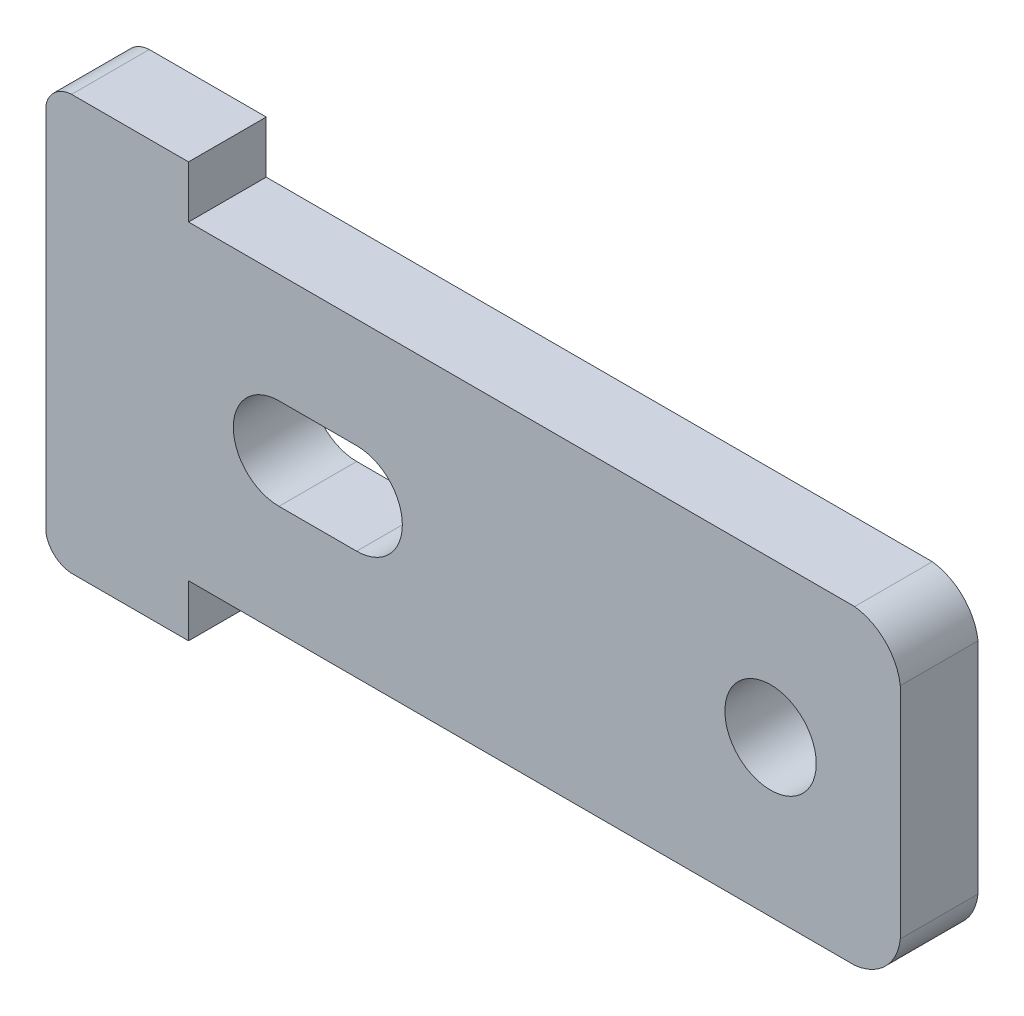
ISO-10303-21;
HEADER;
FILE_DESCRIPTION(('STEP AP214'),'2;1');
FILE_NAME('part.step','',(''),(''),'','','');
FILE_SCHEMA(('AUTOMOTIVE_DESIGN { 1 0 10303 214 1 1 1 1 }'));
ENDSEC;
DATA;
#1=APPLICATION_CONTEXT('core data for automotive mechanical design processes');
#2=APPLICATION_PROTOCOL_DEFINITION('international standard','automotive_design',2000,#1);
#3=PRODUCT_CONTEXT('',#1,'mechanical');
#4=PRODUCT('Part','Part','',(#3));
#5=PRODUCT_RELATED_PRODUCT_CATEGORY('part','',(#4));
#6=PRODUCT_DEFINITION_FORMATION('','',#4);
#7=PRODUCT_DEFINITION_CONTEXT('part definition',#1,'design');
#8=PRODUCT_DEFINITION('design','',#6,#7);
#9=PRODUCT_DEFINITION_SHAPE('','',#8);
#10=(LENGTH_UNIT() NAMED_UNIT(*) SI_UNIT(.MILLI.,.METRE.));
#11=(NAMED_UNIT(*) PLANE_ANGLE_UNIT() SI_UNIT($,.RADIAN.));
#12=(NAMED_UNIT(*) SI_UNIT($,.STERADIAN.) SOLID_ANGLE_UNIT());
#13=UNCERTAINTY_MEASURE_WITH_UNIT(LENGTH_MEASURE(1.E-05),#10,'distance_accuracy_value','');
#14=(GEOMETRIC_REPRESENTATION_CONTEXT(3) GLOBAL_UNCERTAINTY_ASSIGNED_CONTEXT((#13)) GLOBAL_UNIT_ASSIGNED_CONTEXT((#10,
#11,#12)) REPRESENTATION_CONTEXT('',''));
#15=CARTESIAN_POINT('',(0.,0.,0.));
#16=DIRECTION('',(0.,0.,1.));
#17=DIRECTION('',(1.,0.,0.));
#18=AXIS2_PLACEMENT_3D('',#15,#16,#17);
#19=CARTESIAN_POINT('',(46.9587811518595,76.4713390661476,17.9974875144157));
#20=DIRECTION('',(0.,1.,0.));
#21=DIRECTION('',(0.,0.,1.));
#22=AXIS2_PLACEMENT_3D('',#19,#20,#21);
#23=PLANE('',#22);
#24=DIRECTION('',(1.,0.,0.));
#25=VECTOR('',#24,1.);
#26=CARTESIAN_POINT('',(46.9587811518595,76.4713390661476,54.6650738281675));
#27=LINE('',#26,#25);
#28=CARTESIAN_POINT('',(46.9587811518595,76.4713390661476,54.6650738281675));
#29=VERTEX_POINT('',#28);
#30=CARTESIAN_POINT('',(51.4746078539774,76.4713390661476,54.6650738281675));
#31=VERTEX_POINT('',#30);
#32=EDGE_CURVE('E55',#29,#31,#27,.T.);
#33=ORIENTED_EDGE('',*,*,#32,.F.);
#34=DIRECTION('',(0.,0.,1.));
#35=VECTOR('',#34,1.);
#36=CARTESIAN_POINT('',(46.9587811518595,76.4713390661476,17.9974875144157));
#37=LINE('',#36,#35);
#38=CARTESIAN_POINT('',(46.9587811518595,76.4713390661476,57.6650738542446));
#39=VERTEX_POINT('',#38);
#40=EDGE_CURVE('E279',#29,#39,#37,.T.);
#41=ORIENTED_EDGE('',*,*,#40,.T.);
#42=DIRECTION('',(-1.,0.,0.));
#43=VECTOR('',#42,1.);
#44=CARTESIAN_POINT('',(46.9587811518595,76.4713390661476,57.6650738542446));
#45=LINE('',#44,#43);
#46=CARTESIAN_POINT('',(51.4746078539774,76.4713390661476,57.6650738542446));
#47=VERTEX_POINT('',#46);
#48=EDGE_CURVE('E204',#47,#39,#45,.T.);
#49=ORIENTED_EDGE('',*,*,#48,.F.);
#50=DIRECTION('',(0.,0.,1.));
#51=VECTOR('',#50,1.);
#52=CARTESIAN_POINT('',(51.4746078539774,76.4713390661476,17.9974875144157));
#53=LINE('',#52,#51);
#54=EDGE_CURVE('E248',#31,#47,#53,.T.);
#55=ORIENTED_EDGE('',*,*,#54,.F.);
#56=EDGE_LOOP('',(#33,#41,#49,#55));
#57=FACE_BOUND('',#56,.T.);
#58=ADVANCED_FACE('F45',(#57),#23,.T.);
#59=CARTESIAN_POINT('',(47.0069865537006,75.4156807634039,17.9974875144157));
#60=DIRECTION('',(0.,0.,1.));
#61=DIRECTION('',(1.,0.,0.));
#62=AXIS2_PLACEMENT_3D('',#59,#60,#61);
#63=CYLINDRICAL_SURFACE('',#62,1.05675835124136);
#64=CARTESIAN_POINT('',(47.0069865537006,75.4156807634039,54.6650738281675));
#65=DIRECTION('',(0.,0.,1.));
#66=DIRECTION('',(1.,0.,0.));
#67=AXIS2_PLACEMENT_3D('',#64,#65,#66);
#68=CIRCLE('',#67,1.05675835124136);
#69=CARTESIAN_POINT('',(45.9710725832865,75.6245358778236,54.6650738281675));
#70=VERTEX_POINT('',#69);
#71=EDGE_CURVE('E331',#70,#29,#68,.F.);
#72=ORIENTED_EDGE('',*,*,#71,.F.);
#73=DIRECTION('',(0.,0.,1.));
#74=VECTOR('',#73,1.);
#75=CARTESIAN_POINT('',(45.9710725832865,75.6245358778236,17.9974875144157));
#76=LINE('',#75,#74);
#77=CARTESIAN_POINT('',(45.9710725832865,75.6245358778236,57.6650738542446));
#78=VERTEX_POINT('',#77);
#79=EDGE_CURVE('E276',#70,#78,#76,.T.);
#80=ORIENTED_EDGE('',*,*,#79,.T.);
#81=CARTESIAN_POINT('',(47.0069865537006,75.4156807634039,57.6650738542446));
#82=DIRECTION('',(0.,0.,1.));
#83=DIRECTION('',(-1.,0.,0.));
#84=AXIS2_PLACEMENT_3D('',#81,#82,#83);
#85=CIRCLE('',#84,1.05675835124136);
#86=EDGE_CURVE('E208',#39,#78,#85,.T.);
#87=ORIENTED_EDGE('',*,*,#86,.F.);
#88=ORIENTED_EDGE('',*,*,#40,.F.);
#89=EDGE_LOOP('',(#72,#80,#87,#88));
#90=FACE_BOUND('',#89,.T.);
#91=ADVANCED_FACE('F391',(#90),#63,.T.);
#92=CARTESIAN_POINT('',(45.9710725832865,61.3018936408756,17.9974875144157));
#93=DIRECTION('',(-1.,0.,0.));
#94=DIRECTION('',(0.,0.,1.));
#95=AXIS2_PLACEMENT_3D('',#92,#93,#94);
#96=PLANE('',#95);
#97=DIRECTION('',(0.,1.,0.));
#98=VECTOR('',#97,1.);
#99=CARTESIAN_POINT('',(45.9710725832865,61.3018936408756,54.6650738281675));
#100=LINE('',#99,#98);
#101=CARTESIAN_POINT('',(45.9710725832865,61.3018936408756,54.6650738281675));
#102=VERTEX_POINT('',#101);
#103=EDGE_CURVE('E334',#102,#70,#100,.T.);
#104=ORIENTED_EDGE('',*,*,#103,.F.);
#105=DIRECTION('',(0.,0.,1.));
#106=VECTOR('',#105,1.);
#107=CARTESIAN_POINT('',(45.9710725832865,61.3018936408756,17.9974875144157));
#108=LINE('',#107,#106);
#109=CARTESIAN_POINT('',(45.9710725832865,61.3018936408756,57.6650738542446));
#110=VERTEX_POINT('',#109);
#111=EDGE_CURVE('E273',#102,#110,#108,.T.);
#112=ORIENTED_EDGE('',*,*,#111,.T.);
#113=DIRECTION('',(0.,-1.,0.));
#114=VECTOR('',#113,1.);
#115=CARTESIAN_POINT('',(45.9710725832865,61.3018936408756,57.6650738542446));
#116=LINE('',#115,#114);
#117=EDGE_CURVE('E212',#78,#110,#116,.T.);
#118=ORIENTED_EDGE('',*,*,#117,.F.);
#119=ORIENTED_EDGE('',*,*,#79,.F.);
#120=EDGE_LOOP('',(#104,#112,#118,#119));
#121=FACE_BOUND('',#120,.T.);
#122=ADVANCED_FACE('F387',(#121),#96,.T.);
#123=CARTESIAN_POINT('',(47.0069977404311,61.5107618034625,17.9974875144157));
#124=DIRECTION('',(0.,0.,1.));
#125=DIRECTION('',(1.,0.,0.));
#126=AXIS2_PLACEMENT_3D('',#123,#124,#125);
#127=CYLINDRICAL_SURFACE('',#126,1.05677189617608);
#128=CARTESIAN_POINT('',(47.0069977404311,61.5107618034625,54.6650738281675));
#129=DIRECTION('',(0.,0.,1.));
#130=DIRECTION('',(1.,0.,0.));
#131=AXIS2_PLACEMENT_3D('',#128,#129,#130);
#132=CIRCLE('',#131,1.05677189617608);
#133=CARTESIAN_POINT('',(46.9587811518595,60.4550904525516,54.6650738281675));
#134=VERTEX_POINT('',#133);
#135=EDGE_CURVE('E337',#134,#102,#132,.F.);
#136=ORIENTED_EDGE('',*,*,#135,.F.);
#137=DIRECTION('',(0.,0.,1.));
#138=VECTOR('',#137,1.);
#139=CARTESIAN_POINT('',(46.9587811518595,60.4550904525516,17.9974875144157));
#140=LINE('',#139,#138);
#141=CARTESIAN_POINT('',(46.9587811518595,60.4550904525516,57.6650738542446));
#142=VERTEX_POINT('',#141);
#143=EDGE_CURVE('E270',#134,#142,#140,.T.);
#144=ORIENTED_EDGE('',*,*,#143,.T.);
#145=CARTESIAN_POINT('',(47.0069977404311,61.5107618034625,57.6650738542446));
#146=DIRECTION('',(0.,0.,1.));
#147=DIRECTION('',(-1.,0.,0.));
#148=AXIS2_PLACEMENT_3D('',#145,#146,#147);
#149=CIRCLE('',#148,1.05677189617608);
#150=EDGE_CURVE('E216',#110,#142,#149,.T.);
#151=ORIENTED_EDGE('',*,*,#150,.F.);
#152=ORIENTED_EDGE('',*,*,#111,.F.);
#153=EDGE_LOOP('',(#136,#144,#151,#152));
#154=FACE_BOUND('',#153,.T.);
#155=ADVANCED_FACE('F383',(#154),#127,.T.);
#156=CARTESIAN_POINT('',(51.4746078539774,60.4550904525516,17.9974875144157));
#157=DIRECTION('',(0.,-1.,0.));
#158=DIRECTION('',(0.,0.,-1.));
#159=AXIS2_PLACEMENT_3D('',#156,#157,#158);
#160=PLANE('',#159);
#161=DIRECTION('',(-1.,0.,0.));
#162=VECTOR('',#161,1.);
#163=CARTESIAN_POINT('',(51.4746078539774,60.4550904525516,54.6650738281675));
#164=LINE('',#163,#162);
#165=CARTESIAN_POINT('',(51.4746078539774,60.4550904525516,54.6650738281675));
#166=VERTEX_POINT('',#165);
#167=EDGE_CURVE('E340',#166,#134,#164,.T.);
#168=ORIENTED_EDGE('',*,*,#167,.F.);
#169=DIRECTION('',(0.,0.,1.));
#170=VECTOR('',#169,1.);
#171=CARTESIAN_POINT('',(51.4746078539774,60.4550904525516,17.9974875144157));
#172=LINE('',#171,#170);
#173=CARTESIAN_POINT('',(51.4746078539774,60.4550904525516,57.6650738542446));
#174=VERTEX_POINT('',#173);
#175=EDGE_CURVE('E267',#166,#174,#172,.T.);
#176=ORIENTED_EDGE('',*,*,#175,.T.);
#177=DIRECTION('',(1.,0.,0.));
#178=VECTOR('',#177,1.);
#179=CARTESIAN_POINT('',(51.4746078539774,60.4550904525516,57.6650738542446));
#180=LINE('',#179,#178);
#181=EDGE_CURVE('E220',#142,#174,#180,.T.);
#182=ORIENTED_EDGE('',*,*,#181,.F.);
#183=ORIENTED_EDGE('',*,*,#143,.F.);
#184=EDGE_LOOP('',(#168,#176,#182,#183));
#185=FACE_BOUND('',#184,.T.);
#186=ADVANCED_FACE('F377',(#185),#160,.T.);
#187=CARTESIAN_POINT('',(51.4746078539774,62.4659909797905,17.9974875144157));
#188=DIRECTION('',(1.,0.,0.));
#189=DIRECTION('',(0.,0.,-1.));
#190=AXIS2_PLACEMENT_3D('',#187,#188,#189);
#191=PLANE('',#190);
#192=DIRECTION('',(0.,-1.,0.));
#193=VECTOR('',#192,1.);
#194=CARTESIAN_POINT('',(51.4746078539774,62.4659909797905,54.6650738281675));
#195=LINE('',#194,#193);
#196=CARTESIAN_POINT('',(51.4746078539774,62.4659909797905,54.6650738281675));
#197=VERTEX_POINT('',#196);
#198=EDGE_CURVE('E343',#197,#166,#195,.T.);
#199=ORIENTED_EDGE('',*,*,#198,.F.);
#200=DIRECTION('',(0.,0.,1.));
#201=VECTOR('',#200,1.);
#202=CARTESIAN_POINT('',(51.4746078539774,62.4659909797905,17.9974875144157));
#203=LINE('',#202,#201);
#204=CARTESIAN_POINT('',(51.4746078539774,62.4659909797905,57.6650738542446));
#205=VERTEX_POINT('',#204);
#206=EDGE_CURVE('E264',#197,#205,#203,.T.);
#207=ORIENTED_EDGE('',*,*,#206,.T.);
#208=DIRECTION('',(0.,1.,0.));
#209=VECTOR('',#208,1.);
#210=CARTESIAN_POINT('',(51.4746078539774,62.4659909797905,57.6650738542446));
#211=LINE('',#210,#209);
#212=EDGE_CURVE('E224',#174,#205,#211,.T.);
#213=ORIENTED_EDGE('',*,*,#212,.F.);
#214=ORIENTED_EDGE('',*,*,#175,.F.);
#215=EDGE_LOOP('',(#199,#207,#213,#214));
#216=FACE_BOUND('',#215,.T.);
#217=ADVANCED_FACE('F374',(#216),#191,.T.);
#218=CARTESIAN_POINT('',(77.1918812085077,62.4659909797905,17.9974875144157));
#219=DIRECTION('',(0.,-1.,0.));
#220=DIRECTION('',(0.,0.,-1.));
#221=AXIS2_PLACEMENT_3D('',#218,#219,#220);
#222=PLANE('',#221);
#223=DIRECTION('',(-1.,0.,0.));
#224=VECTOR('',#223,1.);
#225=CARTESIAN_POINT('',(77.1918812085077,62.4659909797905,54.6650738281675));
#226=LINE('',#225,#224);
#227=CARTESIAN_POINT('',(77.1918812085077,62.4659909797905,54.6650738281675));
#228=VERTEX_POINT('',#227);
#229=EDGE_CURVE('E346',#228,#197,#226,.T.);
#230=ORIENTED_EDGE('',*,*,#229,.F.);
#231=DIRECTION('',(0.,0.,1.));
#232=VECTOR('',#231,1.);
#233=CARTESIAN_POINT('',(77.1918812085077,62.4659909797905,17.9974875144157));
#234=LINE('',#233,#232);
#235=CARTESIAN_POINT('',(77.1918812085077,62.4659909797905,57.6650738542446));
#236=VERTEX_POINT('',#235);
#237=EDGE_CURVE('E261',#228,#236,#234,.T.);
#238=ORIENTED_EDGE('',*,*,#237,.T.);
#239=DIRECTION('',(1.,0.,0.));
#240=VECTOR('',#239,1.);
#241=CARTESIAN_POINT('',(77.1918812085077,62.4659909797905,57.6650738542446));
#242=LINE('',#241,#240);
#243=EDGE_CURVE('E228',#205,#236,#242,.T.);
#244=ORIENTED_EDGE('',*,*,#243,.F.);
#245=ORIENTED_EDGE('',*,*,#206,.F.);
#246=EDGE_LOOP('',(#230,#238,#244,#245));
#247=FACE_BOUND('',#246,.T.);
#248=ADVANCED_FACE('F369',(#247),#222,.T.);
#249=CARTESIAN_POINT('',(76.984358865494,64.4374255694705,17.9974875144157));
#250=DIRECTION('',(0.,0.,1.));
#251=DIRECTION('',(1.,0.,0.));
#252=AXIS2_PLACEMENT_3D('',#249,#250,#251);
#253=CYLINDRICAL_SURFACE('',#252,1.98232688127785);
#254=CARTESIAN_POINT('',(76.984358865494,64.4374255694705,54.6650738281675));
#255=DIRECTION('',(0.,0.,1.));
#256=DIRECTION('',(1.,0.,0.));
#257=AXIS2_PLACEMENT_3D('',#254,#255,#256);
#258=CIRCLE('',#257,1.98232688127785);
#259=CARTESIAN_POINT('',(78.9557912636682,64.2298824084995,54.6650738281675));
#260=VERTEX_POINT('',#259);
#261=EDGE_CURVE('E349',#260,#228,#258,.F.);
#262=ORIENTED_EDGE('',*,*,#261,.F.);
#263=DIRECTION('',(0.,0.,1.));
#264=VECTOR('',#263,1.);
#265=CARTESIAN_POINT('',(78.9557912636682,64.2298824084995,17.9974875144157));
#266=LINE('',#265,#264);
#267=CARTESIAN_POINT('',(78.9557912636682,64.2298824084995,57.6650738542446));
#268=VERTEX_POINT('',#267);
#269=EDGE_CURVE('E258',#260,#268,#266,.T.);
#270=ORIENTED_EDGE('',*,*,#269,.T.);
#271=CARTESIAN_POINT('',(76.984358865494,64.4374255694705,57.6650738542446));
#272=DIRECTION('',(0.,0.,1.));
#273=DIRECTION('',(1.,0.,0.));
#274=AXIS2_PLACEMENT_3D('',#271,#272,#273);
#275=CIRCLE('',#274,1.98232688127785);
#276=EDGE_CURVE('E232',#236,#268,#275,.T.);
#277=ORIENTED_EDGE('',*,*,#276,.F.);
#278=ORIENTED_EDGE('',*,*,#237,.F.);
#279=EDGE_LOOP('',(#262,#270,#277,#278));
#280=FACE_BOUND('',#279,.T.);
#281=ADVANCED_FACE('F361',(#280),#253,.T.);
#282=CARTESIAN_POINT('',(78.9557912636682,72.6965471101997,17.9974875144157));
#283=DIRECTION('',(1.,0.,0.));
#284=DIRECTION('',(0.,0.,-1.));
#285=AXIS2_PLACEMENT_3D('',#282,#283,#284);
#286=PLANE('',#285);
#287=DIRECTION('',(0.,-1.,0.));
#288=VECTOR('',#287,1.);
#289=CARTESIAN_POINT('',(78.9557912636682,72.6965471101997,54.6650738281675));
#290=LINE('',#289,#288);
#291=CARTESIAN_POINT('',(78.9557912636682,72.6965471101997,54.6650738281675));
#292=VERTEX_POINT('',#291);
#293=EDGE_CURVE('E310',#292,#260,#290,.T.);
#294=ORIENTED_EDGE('',*,*,#293,.F.);
#295=DIRECTION('',(0.,0.,1.));
#296=VECTOR('',#295,1.);
#297=CARTESIAN_POINT('',(78.9557912636682,72.6965471101997,17.9974875144157));
#298=LINE('',#297,#296);
#299=CARTESIAN_POINT('',(78.9557912636682,72.6965471101997,57.6650738542446));
#300=VERTEX_POINT('',#299);
#301=EDGE_CURVE('E255',#292,#300,#298,.T.);
#302=ORIENTED_EDGE('',*,*,#301,.T.);
#303=DIRECTION('',(0.,1.,0.));
#304=VECTOR('',#303,1.);
#305=CARTESIAN_POINT('',(78.9557912636682,72.6965471101997,57.6650738542446));
#306=LINE('',#305,#304);
#307=EDGE_CURVE('E236',#268,#300,#306,.T.);
#308=ORIENTED_EDGE('',*,*,#307,.F.);
#309=ORIENTED_EDGE('',*,*,#269,.F.);
#310=EDGE_LOOP('',(#294,#302,#308,#309));
#311=FACE_BOUND('',#310,.T.);
#312=ADVANCED_FACE('F364',(#311),#286,.T.);
#313=CARTESIAN_POINT('',(76.9482862725808,72.4529267355879,17.9974875144157));
#314=DIRECTION('',(0.,0.,1.));
#315=DIRECTION('',(1.,0.,0.));
#316=AXIS2_PLACEMENT_3D('',#313,#314,#315);
#317=CYLINDRICAL_SURFACE('',#316,2.02223321507859);
#318=CARTESIAN_POINT('',(76.9482862725808,72.4529267355879,54.6650738281675));
#319=DIRECTION('',(0.,0.,1.));
#320=DIRECTION('',(1.,0.,0.));
#321=AXIS2_PLACEMENT_3D('',#318,#319,#320);
#322=CIRCLE('',#321,2.02223321507859);
#323=CARTESIAN_POINT('',(77.1918812085077,74.4604348136184,54.6650738281675));
#324=VERTEX_POINT('',#323);
#325=EDGE_CURVE('E304',#324,#292,#322,.F.);
#326=ORIENTED_EDGE('',*,*,#325,.F.);
#327=DIRECTION('',(0.,0.,1.));
#328=VECTOR('',#327,1.);
#329=CARTESIAN_POINT('',(77.1918812085077,74.4604348136184,17.9974875144157));
#330=LINE('',#329,#328);
#331=CARTESIAN_POINT('',(77.1918812085077,74.4604348136184,57.6650738542446));
#332=VERTEX_POINT('',#331);
#333=EDGE_CURVE('E252',#324,#332,#330,.T.);
#334=ORIENTED_EDGE('',*,*,#333,.T.);
#335=CARTESIAN_POINT('',(76.9482862725808,72.4529267355879,57.6650738542446));
#336=DIRECTION('',(0.,0.,1.));
#337=DIRECTION('',(-1.,0.,0.));
#338=AXIS2_PLACEMENT_3D('',#335,#336,#337);
#339=CIRCLE('',#338,2.02223321507859);
#340=EDGE_CURVE('E240',#300,#332,#339,.T.);
#341=ORIENTED_EDGE('',*,*,#340,.F.);
#342=ORIENTED_EDGE('',*,*,#301,.F.);
#343=EDGE_LOOP('',(#326,#334,#341,#342));
#344=FACE_BOUND('',#343,.T.);
#345=ADVANCED_FACE('F412',(#344),#317,.T.);
#346=CARTESIAN_POINT('',(51.4746078539774,74.4604348136184,17.9974875144157));
#347=DIRECTION('',(0.,1.,0.));
#348=DIRECTION('',(0.,0.,1.));
#349=AXIS2_PLACEMENT_3D('',#346,#347,#348);
#350=PLANE('',#349);
#351=DIRECTION('',(1.,0.,0.));
#352=VECTOR('',#351,1.);
#353=CARTESIAN_POINT('',(51.4746078539774,74.4604348136184,54.6650738281675));
#354=LINE('',#353,#352);
#355=CARTESIAN_POINT('',(51.4746078539774,74.4604348136184,54.6650738281675));
#356=VERTEX_POINT('',#355);
#357=EDGE_CURVE('E300',#356,#324,#354,.T.);
#358=ORIENTED_EDGE('',*,*,#357,.F.);
#359=DIRECTION('',(0.,0.,1.));
#360=VECTOR('',#359,1.);
#361=CARTESIAN_POINT('',(51.4746078539774,74.4604348136184,17.9974875144157));
#362=LINE('',#361,#360);
#363=CARTESIAN_POINT('',(51.4746078539774,74.4604348136184,57.6650738542446));
#364=VERTEX_POINT('',#363);
#365=EDGE_CURVE('E249',#356,#364,#362,.T.);
#366=ORIENTED_EDGE('',*,*,#365,.T.);
#367=DIRECTION('',(-1.,0.,0.));
#368=VECTOR('',#367,1.);
#369=CARTESIAN_POINT('',(51.4746078539774,74.4604348136184,57.6650738542446));
#370=LINE('',#369,#368);
#371=EDGE_CURVE('E244',#332,#364,#370,.T.);
#372=ORIENTED_EDGE('',*,*,#371,.F.);
#373=ORIENTED_EDGE('',*,*,#333,.F.);
#374=EDGE_LOOP('',(#358,#366,#372,#373));
#375=FACE_BOUND('',#374,.T.);
#376=ADVANCED_FACE('F299',(#375),#350,.T.);
#377=CARTESIAN_POINT('',(51.4746078539774,76.4713390661476,17.9974875144157));
#378=DIRECTION('',(1.,0.,0.));
#379=DIRECTION('',(0.,0.,-1.));
#380=AXIS2_PLACEMENT_3D('',#377,#378,#379);
#381=PLANE('',#380);
#382=DIRECTION('',(0.,-1.,0.));
#383=VECTOR('',#382,1.);
#384=CARTESIAN_POINT('',(51.4746078539774,76.4713390661476,54.6650738281675));
#385=LINE('',#384,#383);
#386=EDGE_CURVE('E288',#31,#356,#385,.T.);
#387=ORIENTED_EDGE('',*,*,#386,.F.);
#388=ORIENTED_EDGE('',*,*,#54,.T.);
#389=DIRECTION('',(0.,1.,0.));
#390=VECTOR('',#389,1.);
#391=CARTESIAN_POINT('',(51.4746078539774,76.4713390661476,57.6650738542446));
#392=LINE('',#391,#390);
#393=EDGE_CURVE('E200',#364,#47,#392,.T.);
#394=ORIENTED_EDGE('',*,*,#393,.F.);
#395=ORIENTED_EDGE('',*,*,#365,.F.);
#396=EDGE_LOOP('',(#387,#388,#394,#395));
#397=FACE_BOUND('',#396,.T.);
#398=ADVANCED_FACE('F47',(#397),#381,.T.);
#399=CARTESIAN_POINT('',(73.946274190037,68.4632147593496,17.9974875144157));
#400=DIRECTION('',(0.,0.,1.));
#401=DIRECTION('',(1.,0.,0.));
#402=AXIS2_PLACEMENT_3D('',#399,#400,#401);
#403=CYLINDRICAL_SURFACE('',#402,1.76388956606388);
#404=CARTESIAN_POINT('',(73.946274190037,68.4632147593496,54.6650738281675));
#405=DIRECTION('',(0.,0.,1.));
#406=DIRECTION('',(1.,0.,0.));
#407=AXIS2_PLACEMENT_3D('',#404,#405,#406);
#408=CIRCLE('',#407,1.76388956606388);
#409=CARTESIAN_POINT('',(75.7101637561008,68.4632147593496,54.6650738281675));
#410=VERTEX_POINT('',#409);
#411=EDGE_CURVE('E11',#410,#410,#408,.F.);
#412=ORIENTED_EDGE('',*,*,#411,.T.);
#413=EDGE_LOOP('',(#412));
#414=FACE_BOUND('',#413,.T.);
#415=CARTESIAN_POINT('',(73.946274190037,68.4632147593496,57.6650738542446));
#416=DIRECTION('',(0.,0.,1.));
#417=DIRECTION('',(1.,0.,0.));
#418=AXIS2_PLACEMENT_3D('',#415,#416,#417);
#419=CIRCLE('',#418,1.76388956606388);
#420=CARTESIAN_POINT('',(75.7101637561008,68.4632147593496,57.6650738542446));
#421=VERTEX_POINT('',#420);
#422=EDGE_CURVE('E192',#421,#421,#419,.T.);
#423=ORIENTED_EDGE('',*,*,#422,.T.);
#424=EDGE_LOOP('',(#423));
#425=FACE_BOUND('',#424,.T.);
#426=ADVANCED_FACE('F420',(#414,#425),#403,.F.);
#427=CARTESIAN_POINT('',(76.9482862725808,72.4529267355879,57.6650738542446));
#428=DIRECTION('',(0.,0.,-1.));
#429=DIRECTION('',(-1.,0.,0.));
#430=AXIS2_PLACEMENT_3D('',#427,#428,#429);
#431=PLANE('',#430);
#432=DIRECTION('',(-1.,0.,0.));
#433=VECTOR('',#432,1.);
#434=CARTESIAN_POINT('',(57.9655089665339,70.2271043254135,57.6650738542446));
#435=LINE('',#434,#433);
#436=CARTESIAN_POINT('',(57.9655089665339,70.2271043254135,57.6650738542446));
#437=VERTEX_POINT('',#436);
#438=CARTESIAN_POINT('',(54.9669035960123,70.2271043254135,57.6650738542446));
#439=VERTEX_POINT('',#438);
#440=EDGE_CURVE('E170',#437,#439,#435,.T.);
#441=ORIENTED_EDGE('',*,*,#440,.F.);
#442=CARTESIAN_POINT('',(57.9655089665339,68.4632147593496,57.6650738542446));
#443=DIRECTION('',(0.,0.,1.));
#444=DIRECTION('',(1.,0.,0.));
#445=AXIS2_PLACEMENT_3D('',#442,#443,#444);
#446=CIRCLE('',#445,1.76388956606388);
#447=CARTESIAN_POINT('',(57.9655089665339,66.6993251932857,57.6650738542446));
#448=VERTEX_POINT('',#447);
#449=EDGE_CURVE('E177',#448,#437,#446,.T.);
#450=ORIENTED_EDGE('',*,*,#449,.F.);
#451=DIRECTION('',(1.,0.,0.));
#452=VECTOR('',#451,1.);
#453=CARTESIAN_POINT('',(57.9655089665339,66.6993251932857,57.6650738542446));
#454=LINE('',#453,#452);
#455=CARTESIAN_POINT('',(54.9669035960123,66.6993251932857,57.6650738542446));
#456=VERTEX_POINT('',#455);
#457=EDGE_CURVE('E182',#456,#448,#454,.T.);
#458=ORIENTED_EDGE('',*,*,#457,.F.);
#459=CARTESIAN_POINT('',(54.9669035960123,68.4632147593496,57.6650738542446));
#460=DIRECTION('',(0.,0.,1.));
#461=DIRECTION('',(1.,0.,0.));
#462=AXIS2_PLACEMENT_3D('',#459,#460,#461);
#463=CIRCLE('',#462,1.76388956606389);
#464=EDGE_CURVE('E162',#439,#456,#463,.T.);
#465=ORIENTED_EDGE('',*,*,#464,.F.);
#466=EDGE_LOOP('',(#441,#450,#458,#465));
#467=FACE_BOUND('',#466,.T.);
#468=ORIENTED_EDGE('',*,*,#422,.F.);
#469=EDGE_LOOP('',(#468));
#470=FACE_BOUND('',#469,.T.);
#471=ORIENTED_EDGE('',*,*,#393,.T.);
#472=ORIENTED_EDGE('',*,*,#48,.T.);
#473=ORIENTED_EDGE('',*,*,#86,.T.);
#474=ORIENTED_EDGE('',*,*,#117,.T.);
#475=ORIENTED_EDGE('',*,*,#150,.T.);
#476=ORIENTED_EDGE('',*,*,#181,.T.);
#477=ORIENTED_EDGE('',*,*,#212,.T.);
#478=ORIENTED_EDGE('',*,*,#243,.T.);
#479=ORIENTED_EDGE('',*,*,#276,.T.);
#480=ORIENTED_EDGE('',*,*,#307,.T.);
#481=ORIENTED_EDGE('',*,*,#340,.T.);
#482=ORIENTED_EDGE('',*,*,#371,.T.);
#483=EDGE_LOOP('',(#471,#472,#473,#474,#475,#476,#477,#478,#479,#480,#481,#482));
#484=FACE_BOUND('',#483,.T.);
#485=ADVANCED_FACE('F179',(#467,#470,#484),#431,.F.);
#486=CARTESIAN_POINT('',(57.9655089665339,70.2271043254135,17.9974875144157));
#487=DIRECTION('',(0.,1.,0.));
#488=DIRECTION('',(0.,0.,1.));
#489=AXIS2_PLACEMENT_3D('',#486,#487,#488);
#490=PLANE('',#489);
#491=DIRECTION('',(0.,0.,1.));
#492=VECTOR('',#491,1.);
#493=CARTESIAN_POINT('',(54.9669035960123,70.2271043254135,17.9974875144157));
#494=LINE('',#493,#492);
#495=CARTESIAN_POINT('',(54.9669035960123,70.2271043254135,54.6650738281675));
#496=VERTEX_POINT('',#495);
#497=EDGE_CURVE('E158',#496,#439,#494,.T.);
#498=ORIENTED_EDGE('',*,*,#497,.F.);
#499=DIRECTION('',(1.,0.,0.));
#500=VECTOR('',#499,1.);
#501=CARTESIAN_POINT('',(57.9655089665339,70.2271043254135,54.6650738281675));
#502=LINE('',#501,#500);
#503=CARTESIAN_POINT('',(57.9655089665339,70.2271043254135,54.6650738281675));
#504=VERTEX_POINT('',#503);
#505=EDGE_CURVE('E49',#496,#504,#502,.T.);
#506=ORIENTED_EDGE('',*,*,#505,.T.);
#507=DIRECTION('',(0.,0.,1.));
#508=VECTOR('',#507,1.);
#509=CARTESIAN_POINT('',(57.9655089665339,70.2271043254135,17.9974875144157));
#510=LINE('',#509,#508);
#511=EDGE_CURVE('E167',#504,#437,#510,.T.);
#512=ORIENTED_EDGE('',*,*,#511,.T.);
#513=ORIENTED_EDGE('',*,*,#440,.T.);
#514=EDGE_LOOP('',(#498,#506,#512,#513));
#515=FACE_BOUND('',#514,.T.);
#516=ADVANCED_FACE('F171',(#515),#490,.F.);
#517=CARTESIAN_POINT('',(54.9669035960123,68.4632147593496,17.9974875144157));
#518=DIRECTION('',(0.,0.,1.));
#519=DIRECTION('',(1.,0.,0.));
#520=AXIS2_PLACEMENT_3D('',#517,#518,#519);
#521=CYLINDRICAL_SURFACE('',#520,1.76388956606389);
#522=DIRECTION('',(0.,0.,1.));
#523=VECTOR('',#522,1.);
#524=CARTESIAN_POINT('',(54.9669035960123,66.6993251932857,17.9974875144157));
#525=LINE('',#524,#523);
#526=CARTESIAN_POINT('',(54.9669035960123,66.6993251932857,54.6650738281675));
#527=VERTEX_POINT('',#526);
#528=EDGE_CURVE('E166',#527,#456,#525,.T.);
#529=ORIENTED_EDGE('',*,*,#528,.F.);
#530=CARTESIAN_POINT('',(54.9669035960123,68.4632147593496,54.6650738281675));
#531=DIRECTION('',(0.,0.,1.));
#532=DIRECTION('',(1.,0.,0.));
#533=AXIS2_PLACEMENT_3D('',#530,#531,#532);
#534=CIRCLE('',#533,1.76388956606389);
#535=EDGE_CURVE('E66',#527,#496,#534,.F.);
#536=ORIENTED_EDGE('',*,*,#535,.T.);
#537=ORIENTED_EDGE('',*,*,#497,.T.);
#538=ORIENTED_EDGE('',*,*,#464,.T.);
#539=EDGE_LOOP('',(#529,#536,#537,#538));
#540=FACE_BOUND('',#539,.T.);
#541=ADVANCED_FACE('F160',(#540),#521,.F.);
#542=CARTESIAN_POINT('',(57.9655089665339,66.6993251932857,17.9974875144157));
#543=DIRECTION('',(0.,-1.,0.));
#544=DIRECTION('',(1.,0.,0.));
#545=AXIS2_PLACEMENT_3D('',#542,#543,#544);
#546=PLANE('',#545);
#547=DIRECTION('',(0.,0.,1.));
#548=VECTOR('',#547,1.);
#549=CARTESIAN_POINT('',(57.9655089665339,66.6993251932857,17.9974875144157));
#550=LINE('',#549,#548);
#551=CARTESIAN_POINT('',(57.9655089665339,66.6993251932857,54.6650738281675));
#552=VERTEX_POINT('',#551);
#553=EDGE_CURVE('E189',#552,#448,#550,.T.);
#554=ORIENTED_EDGE('',*,*,#553,.F.);
#555=DIRECTION('',(-1.,0.,0.));
#556=VECTOR('',#555,1.);
#557=CARTESIAN_POINT('',(57.9655089665339,66.6993251932857,54.6650738281675));
#558=LINE('',#557,#556);
#559=EDGE_CURVE('E321',#552,#527,#558,.T.);
#560=ORIENTED_EDGE('',*,*,#559,.T.);
#561=ORIENTED_EDGE('',*,*,#528,.T.);
#562=ORIENTED_EDGE('',*,*,#457,.T.);
#563=EDGE_LOOP('',(#554,#560,#561,#562));
#564=FACE_BOUND('',#563,.T.);
#565=ADVANCED_FACE('F320',(#564),#546,.F.);
#566=CARTESIAN_POINT('',(57.9655089665339,68.4632147593496,17.9974875144157));
#567=DIRECTION('',(0.,0.,1.));
#568=DIRECTION('',(1.,0.,0.));
#569=AXIS2_PLACEMENT_3D('',#566,#567,#568);
#570=CYLINDRICAL_SURFACE('',#569,1.76388956606388);
#571=ORIENTED_EDGE('',*,*,#511,.F.);
#572=CARTESIAN_POINT('',(57.9655089665339,68.4632147593496,54.6650738281675));
#573=DIRECTION('',(0.,0.,1.));
#574=DIRECTION('',(1.,0.,0.));
#575=AXIS2_PLACEMENT_3D('',#572,#573,#574);
#576=CIRCLE('',#575,1.76388956606388);
#577=EDGE_CURVE('E308',#504,#552,#576,.F.);
#578=ORIENTED_EDGE('',*,*,#577,.T.);
#579=ORIENTED_EDGE('',*,*,#553,.T.);
#580=ORIENTED_EDGE('',*,*,#449,.T.);
#581=EDGE_LOOP('',(#571,#578,#579,#580));
#582=FACE_BOUND('',#581,.T.);
#583=ADVANCED_FACE('F315',(#582),#570,.F.);
#584=CARTESIAN_POINT('',(-137.931921214969,26.6707605613468,54.6650738281675));
#585=DIRECTION('',(0.,0.,1.));
#586=DIRECTION('',(1.,0.,0.));
#587=AXIS2_PLACEMENT_3D('',#584,#585,#586);
#588=PLANE('',#587);
#589=ORIENTED_EDGE('',*,*,#386,.T.);
#590=ORIENTED_EDGE('',*,*,#357,.T.);
#591=ORIENTED_EDGE('',*,*,#325,.T.);
#592=ORIENTED_EDGE('',*,*,#293,.T.);
#593=ORIENTED_EDGE('',*,*,#261,.T.);
#594=ORIENTED_EDGE('',*,*,#229,.T.);
#595=ORIENTED_EDGE('',*,*,#198,.T.);
#596=ORIENTED_EDGE('',*,*,#167,.T.);
#597=ORIENTED_EDGE('',*,*,#135,.T.);
#598=ORIENTED_EDGE('',*,*,#103,.T.);
#599=ORIENTED_EDGE('',*,*,#71,.T.);
#600=ORIENTED_EDGE('',*,*,#32,.T.);
#601=EDGE_LOOP('',(#589,#590,#591,#592,#593,#594,#595,#596,#597,#598,#599,#600));
#602=FACE_BOUND('',#601,.T.);
#603=ORIENTED_EDGE('',*,*,#505,.F.);
#604=ORIENTED_EDGE('',*,*,#535,.F.);
#605=ORIENTED_EDGE('',*,*,#559,.F.);
#606=ORIENTED_EDGE('',*,*,#577,.F.);
#607=EDGE_LOOP('',(#603,#604,#605,#606));
#608=FACE_BOUND('',#607,.T.);
#609=ORIENTED_EDGE('',*,*,#411,.F.);
#610=EDGE_LOOP('',(#609));
#611=FACE_BOUND('',#610,.T.);
#612=ADVANCED_FACE('F354',(#602,#608,#611),#588,.F.);
#613=CLOSED_SHELL('',(#58,#91,#122,#155,#186,#217,#248,#281,#312,#345,#376,#398,#426,#485,#516,
#541,#565,#583,#612));
#614=MANIFOLD_SOLID_BREP('B2',#613);
#615=ADVANCED_BREP_SHAPE_REPRESENTATION('',(#18,#614),#14);
#616=SHAPE_DEFINITION_REPRESENTATION(#9,#615);
ENDSEC;
END-ISO-10303-21;
